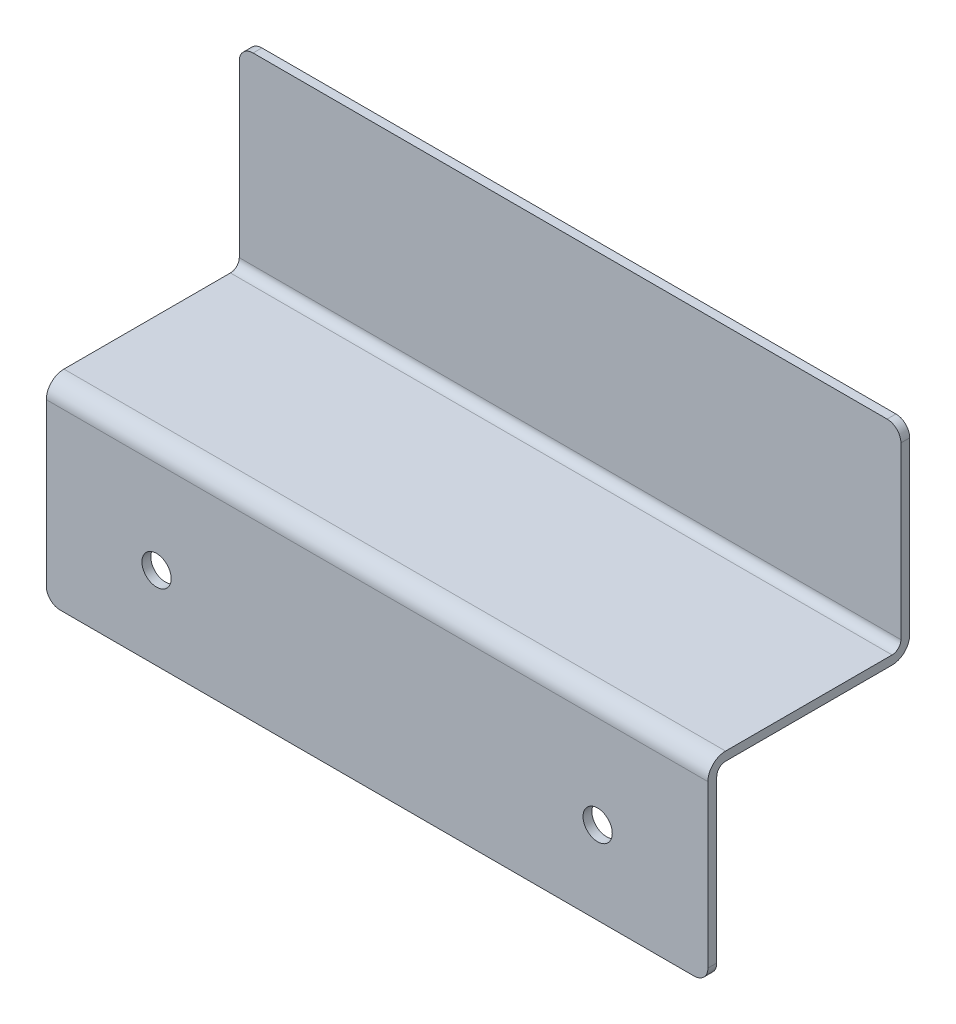
ISO-10303-21;
HEADER;
FILE_DESCRIPTION(('STEP AP214'),'2;1');
FILE_NAME('part.step','',(''),(''),'','','');
FILE_SCHEMA(('AUTOMOTIVE_DESIGN { 1 0 10303 214 1 1 1 1 }'));
ENDSEC;
DATA;
#1=APPLICATION_CONTEXT('core data for automotive mechanical design processes');
#2=APPLICATION_PROTOCOL_DEFINITION('international standard','automotive_design',2000,#1);
#3=PRODUCT_CONTEXT('',#1,'mechanical');
#4=PRODUCT('Part','Part','',(#3));
#5=PRODUCT_RELATED_PRODUCT_CATEGORY('part','',(#4));
#6=PRODUCT_DEFINITION_FORMATION('','',#4);
#7=PRODUCT_DEFINITION_CONTEXT('part definition',#1,'design');
#8=PRODUCT_DEFINITION('design','',#6,#7);
#9=PRODUCT_DEFINITION_SHAPE('','',#8);
#10=(LENGTH_UNIT() NAMED_UNIT(*) SI_UNIT(.MILLI.,.METRE.));
#11=(NAMED_UNIT(*) PLANE_ANGLE_UNIT() SI_UNIT($,.RADIAN.));
#12=(NAMED_UNIT(*) SI_UNIT($,.STERADIAN.) SOLID_ANGLE_UNIT());
#13=UNCERTAINTY_MEASURE_WITH_UNIT(LENGTH_MEASURE(1.E-05),#10,'distance_accuracy_value','');
#14=(GEOMETRIC_REPRESENTATION_CONTEXT(3) GLOBAL_UNCERTAINTY_ASSIGNED_CONTEXT((#13)) GLOBAL_UNIT_ASSIGNED_CONTEXT((#10,
#11,#12)) REPRESENTATION_CONTEXT('',''));
#15=CARTESIAN_POINT('',(0.,0.,0.));
#16=DIRECTION('',(0.,0.,1.));
#17=DIRECTION('',(1.,0.,0.));
#18=AXIS2_PLACEMENT_3D('',#15,#16,#17);
#19=CARTESIAN_POINT('',(152.4,0.,0.));
#20=DIRECTION('',(0.,-1.,0.));
#21=DIRECTION('',(0.,0.,-1.));
#22=AXIS2_PLACEMENT_3D('',#19,#20,#21);
#23=PLANE('',#22);
#24=DIRECTION('',(-1.,0.,0.));
#25=VECTOR('',#24,1.);
#26=CARTESIAN_POINT('',(152.4,0.,-2.032));
#27=LINE('',#26,#25);
#28=CARTESIAN_POINT('',(149.225,0.,-2.032));
#29=VERTEX_POINT('',#28);
#30=CARTESIAN_POINT('',(3.17500000000007,0.,-2.032));
#31=VERTEX_POINT('',#30);
#32=EDGE_CURVE('E192',#29,#31,#27,.T.);
#33=ORIENTED_EDGE('',*,*,#32,.T.);
#34=DIRECTION('',(0.,0.,1.));
#35=VECTOR('',#34,1.);
#36=CARTESIAN_POINT('',(3.17500000000001,0.,0.));
#37=LINE('',#36,#35);
#38=CARTESIAN_POINT('',(3.17500000000007,0.,0.));
#39=VERTEX_POINT('',#38);
#40=EDGE_CURVE('E252',#31,#39,#37,.T.);
#41=ORIENTED_EDGE('',*,*,#40,.T.);
#42=DIRECTION('',(-1.,0.,0.));
#43=VECTOR('',#42,1.);
#44=CARTESIAN_POINT('',(152.4,0.,0.));
#45=LINE('',#44,#43);
#46=CARTESIAN_POINT('',(149.225,0.,0.));
#47=VERTEX_POINT('',#46);
#48=EDGE_CURVE('E177',#47,#39,#45,.T.);
#49=ORIENTED_EDGE('',*,*,#48,.F.);
#50=DIRECTION('',(0.,0.,1.));
#51=VECTOR('',#50,1.);
#52=CARTESIAN_POINT('',(149.225,0.,0.));
#53=LINE('',#52,#51);
#54=EDGE_CURVE('E250',#47,#29,#53,.F.);
#55=ORIENTED_EDGE('',*,*,#54,.T.);
#56=EDGE_LOOP('',(#33,#41,#49,#55));
#57=FACE_BOUND('',#56,.T.);
#58=ADVANCED_FACE('F37',(#57),#23,.F.);
#59=CARTESIAN_POINT('',(152.4,0.,0.));
#60=DIRECTION('',(0.,0.,-1.));
#61=DIRECTION('',(0.,1.,0.));
#62=AXIS2_PLACEMENT_3D('',#59,#60,#61);
#63=PLANE('',#62);
#64=ORIENTED_EDGE('',*,*,#48,.T.);
#65=CARTESIAN_POINT('',(3.17500000000001,-3.175,0.));
#66=DIRECTION('',(0.,0.,-1.));
#67=DIRECTION('',(0.,1.,0.));
#68=AXIS2_PLACEMENT_3D('',#65,#66,#67);
#69=CIRCLE('',#68,3.175);
#70=CARTESIAN_POINT('',(0.,-3.175,0.));
#71=VERTEX_POINT('',#70);
#72=EDGE_CURVE('E256',#39,#71,#69,.F.);
#73=ORIENTED_EDGE('',*,*,#72,.T.);
#74=DIRECTION('',(0.,-1.,0.));
#75=VECTOR('',#74,1.);
#76=CARTESIAN_POINT('',(0.,0.,0.));
#77=LINE('',#76,#75);
#78=CARTESIAN_POINT('',(0.,-42.418,0.));
#79=VERTEX_POINT('',#78);
#80=EDGE_CURVE('E267',#71,#79,#77,.T.);
#81=ORIENTED_EDGE('',*,*,#80,.T.);
#82=DIRECTION('',(-1.,0.,0.));
#83=VECTOR('',#82,1.);
#84=CARTESIAN_POINT('',(152.4,-42.418,0.));
#85=LINE('',#84,#83);
#86=CARTESIAN_POINT('',(152.4,-42.418,0.));
#87=VERTEX_POINT('',#86);
#88=EDGE_CURVE('E167',#79,#87,#85,.F.);
#89=ORIENTED_EDGE('',*,*,#88,.T.);
#90=DIRECTION('',(0.,-1.,0.));
#91=VECTOR('',#90,1.);
#92=CARTESIAN_POINT('',(152.4,0.,0.));
#93=LINE('',#92,#91);
#94=CARTESIAN_POINT('',(152.4,-3.175,0.));
#95=VERTEX_POINT('',#94);
#96=EDGE_CURVE('E186',#95,#87,#93,.T.);
#97=ORIENTED_EDGE('',*,*,#96,.F.);
#98=CARTESIAN_POINT('',(149.225,-3.175,0.));
#99=DIRECTION('',(0.,0.,-1.));
#100=DIRECTION('',(0.,1.,0.));
#101=AXIS2_PLACEMENT_3D('',#98,#99,#100);
#102=CIRCLE('',#101,3.175);
#103=EDGE_CURVE('E62',#95,#47,#102,.F.);
#104=ORIENTED_EDGE('',*,*,#103,.T.);
#105=EDGE_LOOP('',(#64,#73,#81,#89,#97,#104));
#106=FACE_BOUND('',#105,.T.);
#107=ADVANCED_FACE('F339',(#106),#63,.F.);
#108=CARTESIAN_POINT('',(152.4,-44.45,0.));
#109=DIRECTION('',(0.,-1.,0.));
#110=DIRECTION('',(0.,0.,-1.));
#111=AXIS2_PLACEMENT_3D('',#108,#109,#110);
#112=PLANE('',#111);
#113=DIRECTION('',(0.,0.,1.));
#114=VECTOR('',#113,1.);
#115=CARTESIAN_POINT('',(0.,-44.45,0.));
#116=LINE('',#115,#114);
#117=CARTESIAN_POINT('',(0.,-44.45,2.03199999999999));
#118=VERTEX_POINT('',#117);
#119=CARTESIAN_POINT('',(0.,-44.45,40.386));
#120=VERTEX_POINT('',#119);
#121=EDGE_CURVE('E288',#118,#120,#116,.T.);
#122=ORIENTED_EDGE('',*,*,#121,.T.);
#123=DIRECTION('',(-1.,0.,0.));
#124=VECTOR('',#123,1.);
#125=CARTESIAN_POINT('',(152.4,-44.45,40.386));
#126=LINE('',#125,#124);
#127=CARTESIAN_POINT('',(152.4,-44.45,40.386));
#128=VERTEX_POINT('',#127);
#129=EDGE_CURVE('E222',#120,#128,#126,.F.);
#130=ORIENTED_EDGE('',*,*,#129,.T.);
#131=DIRECTION('',(0.,0.,1.));
#132=VECTOR('',#131,1.);
#133=CARTESIAN_POINT('',(152.4,-44.45,0.));
#134=LINE('',#133,#132);
#135=CARTESIAN_POINT('',(152.4,-44.45,2.03199999999999));
#136=VERTEX_POINT('',#135);
#137=EDGE_CURVE('E277',#136,#128,#134,.T.);
#138=ORIENTED_EDGE('',*,*,#137,.F.);
#139=DIRECTION('',(-1.,0.,0.));
#140=VECTOR('',#139,1.);
#141=CARTESIAN_POINT('',(0.,-44.45,2.03199999999999));
#142=LINE('',#141,#140);
#143=EDGE_CURVE('E205',#136,#118,#142,.T.);
#144=ORIENTED_EDGE('',*,*,#143,.T.);
#145=EDGE_LOOP('',(#122,#130,#138,#144));
#146=FACE_BOUND('',#145,.T.);
#147=ADVANCED_FACE('F321',(#146),#112,.F.);
#148=CARTESIAN_POINT('',(152.4,-44.45,44.45));
#149=DIRECTION('',(0.,0.,-1.));
#150=DIRECTION('',(0.,1.,0.));
#151=AXIS2_PLACEMENT_3D('',#148,#149,#150);
#152=PLANE('',#151);
#153=CARTESIAN_POINT('',(25.4,-69.85,44.45));
#154=DIRECTION('',(0.,0.,1.));
#155=DIRECTION('',(1.,0.,0.));
#156=AXIS2_PLACEMENT_3D('',#153,#154,#155);
#157=CIRCLE('',#156,3.3655);
#158=CARTESIAN_POINT('',(28.7655,-69.85,44.45));
#159=VERTEX_POINT('',#158);
#160=EDGE_CURVE('E263',#159,#159,#157,.T.);
#161=ORIENTED_EDGE('',*,*,#160,.F.);
#162=EDGE_LOOP('',(#161));
#163=FACE_BOUND('',#162,.T.);
#164=CARTESIAN_POINT('',(127.,-69.85,44.45));
#165=DIRECTION('',(0.,0.,1.));
#166=DIRECTION('',(1.,0.,0.));
#167=AXIS2_PLACEMENT_3D('',#164,#165,#166);
#168=CIRCLE('',#167,3.36549999999999);
#169=CARTESIAN_POINT('',(130.3655,-69.85,44.45));
#170=VERTEX_POINT('',#169);
#171=EDGE_CURVE('E269',#170,#170,#168,.T.);
#172=ORIENTED_EDGE('',*,*,#171,.F.);
#173=EDGE_LOOP('',(#172));
#174=FACE_BOUND('',#173,.T.);
#175=DIRECTION('',(0.,-1.,0.));
#176=VECTOR('',#175,1.);
#177=CARTESIAN_POINT('',(0.,-44.45,44.45));
#178=LINE('',#177,#176);
#179=CARTESIAN_POINT('',(0.,-48.514,44.45));
#180=VERTEX_POINT('',#179);
#181=CARTESIAN_POINT('',(0.,-85.725,44.45));
#182=VERTEX_POINT('',#181);
#183=EDGE_CURVE('E188',#180,#182,#178,.T.);
#184=ORIENTED_EDGE('',*,*,#183,.T.);
#185=CARTESIAN_POINT('',(3.17500000000001,-85.725,44.45));
#186=DIRECTION('',(0.,0.,-1.));
#187=DIRECTION('',(0.,1.,0.));
#188=AXIS2_PLACEMENT_3D('',#185,#186,#187);
#189=CIRCLE('',#188,3.175);
#190=CARTESIAN_POINT('',(3.17500000000007,-88.9,44.45));
#191=VERTEX_POINT('',#190);
#192=EDGE_CURVE('E248',#182,#191,#189,.F.);
#193=ORIENTED_EDGE('',*,*,#192,.T.);
#194=DIRECTION('',(-1.,0.,0.));
#195=VECTOR('',#194,1.);
#196=CARTESIAN_POINT('',(152.4,-88.9,44.45));
#197=LINE('',#196,#195);
#198=CARTESIAN_POINT('',(149.225,-88.9,44.45));
#199=VERTEX_POINT('',#198);
#200=EDGE_CURVE('E199',#199,#191,#197,.T.);
#201=ORIENTED_EDGE('',*,*,#200,.F.);
#202=CARTESIAN_POINT('',(149.225,-85.725,44.45));
#203=DIRECTION('',(0.,0.,-1.));
#204=DIRECTION('',(0.,1.,0.));
#205=AXIS2_PLACEMENT_3D('',#202,#203,#204);
#206=CIRCLE('',#205,3.175);
#207=CARTESIAN_POINT('',(152.4,-85.725,44.45));
#208=VERTEX_POINT('',#207);
#209=EDGE_CURVE('E246',#199,#208,#206,.F.);
#210=ORIENTED_EDGE('',*,*,#209,.T.);
#211=DIRECTION('',(0.,-1.,0.));
#212=VECTOR('',#211,1.);
#213=CARTESIAN_POINT('',(152.4,-44.45,44.45));
#214=LINE('',#213,#212);
#215=CARTESIAN_POINT('',(152.4,-48.514,44.45));
#216=VERTEX_POINT('',#215);
#217=EDGE_CURVE('E280',#216,#208,#214,.T.);
#218=ORIENTED_EDGE('',*,*,#217,.F.);
#219=DIRECTION('',(-1.,0.,0.));
#220=VECTOR('',#219,1.);
#221=CARTESIAN_POINT('',(152.4,-48.514,44.45));
#222=LINE('',#221,#220);
#223=EDGE_CURVE('E216',#216,#180,#222,.T.);
#224=ORIENTED_EDGE('',*,*,#223,.T.);
#225=EDGE_LOOP('',(#184,#193,#201,#210,#218,#224));
#226=FACE_BOUND('',#225,.T.);
#227=ADVANCED_FACE('F294',(#163,#174,#226),#152,.F.);
#228=CARTESIAN_POINT('',(152.4,-88.9,44.45));
#229=DIRECTION('',(0.,1.,0.));
#230=DIRECTION('',(0.,0.,1.));
#231=AXIS2_PLACEMENT_3D('',#228,#229,#230);
#232=PLANE('',#231);
#233=ORIENTED_EDGE('',*,*,#200,.T.);
#234=DIRECTION('',(0.,0.,-1.));
#235=VECTOR('',#234,1.);
#236=CARTESIAN_POINT('',(3.17500000000001,-88.9,42.418));
#237=LINE('',#236,#235);
#238=CARTESIAN_POINT('',(3.17500000000007,-88.9,42.418));
#239=VERTEX_POINT('',#238);
#240=EDGE_CURVE('E235',#191,#239,#237,.T.);
#241=ORIENTED_EDGE('',*,*,#240,.T.);
#242=DIRECTION('',(-1.,0.,0.));
#243=VECTOR('',#242,1.);
#244=CARTESIAN_POINT('',(152.4,-88.9,42.418));
#245=LINE('',#244,#243);
#246=CARTESIAN_POINT('',(149.225,-88.9,42.418));
#247=VERTEX_POINT('',#246);
#248=EDGE_CURVE('E195',#247,#239,#245,.T.);
#249=ORIENTED_EDGE('',*,*,#248,.F.);
#250=DIRECTION('',(0.,0.,-1.));
#251=VECTOR('',#250,1.);
#252=CARTESIAN_POINT('',(149.225,-88.9,44.45));
#253=LINE('',#252,#251);
#254=EDGE_CURVE('E233',#247,#199,#253,.F.);
#255=ORIENTED_EDGE('',*,*,#254,.T.);
#256=EDGE_LOOP('',(#233,#241,#249,#255));
#257=FACE_BOUND('',#256,.T.);
#258=ADVANCED_FACE('F304',(#257),#232,.F.);
#259=CARTESIAN_POINT('',(152.4,-46.482,42.418));
#260=DIRECTION('',(0.,0.,1.));
#261=DIRECTION('',(0.,-1.,0.));
#262=AXIS2_PLACEMENT_3D('',#259,#260,#261);
#263=PLANE('',#262);
#264=CARTESIAN_POINT('',(25.4,-69.85,42.418));
#265=DIRECTION('',(0.,0.,1.));
#266=DIRECTION('',(0.,-1.,0.));
#267=AXIS2_PLACEMENT_3D('',#264,#265,#266);
#268=CIRCLE('',#267,3.3655);
#269=CARTESIAN_POINT('',(25.4,-73.2155,42.418));
#270=VERTEX_POINT('',#269);
#271=EDGE_CURVE('E41',#270,#270,#268,.T.);
#272=ORIENTED_EDGE('',*,*,#271,.T.);
#273=EDGE_LOOP('',(#272));
#274=FACE_BOUND('',#273,.T.);
#275=CARTESIAN_POINT('',(127.,-69.85,42.418));
#276=DIRECTION('',(0.,0.,1.));
#277=DIRECTION('',(0.,-1.,0.));
#278=AXIS2_PLACEMENT_3D('',#275,#276,#277);
#279=CIRCLE('',#278,3.36549999999999);
#280=CARTESIAN_POINT('',(127.,-73.2155,42.418));
#281=VERTEX_POINT('',#280);
#282=EDGE_CURVE('E261',#281,#281,#279,.T.);
#283=ORIENTED_EDGE('',*,*,#282,.T.);
#284=EDGE_LOOP('',(#283));
#285=FACE_BOUND('',#284,.T.);
#286=ORIENTED_EDGE('',*,*,#248,.T.);
#287=CARTESIAN_POINT('',(3.17500000000001,-85.725,42.418));
#288=DIRECTION('',(0.,0.,1.));
#289=DIRECTION('',(0.,-1.,0.));
#290=AXIS2_PLACEMENT_3D('',#287,#288,#289);
#291=CIRCLE('',#290,3.175);
#292=CARTESIAN_POINT('',(0.,-85.725,42.418));
#293=VERTEX_POINT('',#292);
#294=EDGE_CURVE('E240',#239,#293,#291,.F.);
#295=ORIENTED_EDGE('',*,*,#294,.T.);
#296=DIRECTION('',(0.,1.,0.));
#297=VECTOR('',#296,1.);
#298=CARTESIAN_POINT('',(0.,-46.482,42.418));
#299=LINE('',#298,#297);
#300=CARTESIAN_POINT('',(0.,-48.514,42.418));
#301=VERTEX_POINT('',#300);
#302=EDGE_CURVE('E183',#293,#301,#299,.T.);
#303=ORIENTED_EDGE('',*,*,#302,.T.);
#304=DIRECTION('',(-1.,0.,0.));
#305=VECTOR('',#304,1.);
#306=CARTESIAN_POINT('',(152.4,-48.514,42.418));
#307=LINE('',#306,#305);
#308=CARTESIAN_POINT('',(152.4,-48.514,42.418));
#309=VERTEX_POINT('',#308);
#310=EDGE_CURVE('E162',#301,#309,#307,.F.);
#311=ORIENTED_EDGE('',*,*,#310,.T.);
#312=DIRECTION('',(0.,1.,0.));
#313=VECTOR('',#312,1.);
#314=CARTESIAN_POINT('',(152.4,-46.482,42.418));
#315=LINE('',#314,#313);
#316=CARTESIAN_POINT('',(152.4,-85.725,42.418));
#317=VERTEX_POINT('',#316);
#318=EDGE_CURVE('E283',#317,#309,#315,.T.);
#319=ORIENTED_EDGE('',*,*,#318,.F.);
#320=CARTESIAN_POINT('',(149.225,-85.725,42.418));
#321=DIRECTION('',(0.,0.,1.));
#322=DIRECTION('',(0.,-1.,0.));
#323=AXIS2_PLACEMENT_3D('',#320,#321,#322);
#324=CIRCLE('',#323,3.175);
#325=EDGE_CURVE('E238',#317,#247,#324,.F.);
#326=ORIENTED_EDGE('',*,*,#325,.T.);
#327=EDGE_LOOP('',(#286,#295,#303,#311,#319,#326));
#328=FACE_BOUND('',#327,.T.);
#329=ADVANCED_FACE('F307',(#274,#285,#328),#263,.F.);
#330=CARTESIAN_POINT('',(152.4,-46.482,-2.03200000000001));
#331=DIRECTION('',(0.,1.,0.));
#332=DIRECTION('',(0.,0.,1.));
#333=AXIS2_PLACEMENT_3D('',#330,#331,#332);
#334=PLANE('',#333);
#335=DIRECTION('',(0.,0.,-1.));
#336=VECTOR('',#335,1.);
#337=CARTESIAN_POINT('',(0.,-46.482,-2.03200000000001));
#338=LINE('',#337,#336);
#339=CARTESIAN_POINT('',(0.,-46.482,40.386));
#340=VERTEX_POINT('',#339);
#341=CARTESIAN_POINT('',(0.,-46.482,2.03199999999999));
#342=VERTEX_POINT('',#341);
#343=EDGE_CURVE('E173',#340,#342,#338,.T.);
#344=ORIENTED_EDGE('',*,*,#343,.T.);
#345=DIRECTION('',(-1.,0.,0.));
#346=VECTOR('',#345,1.);
#347=CARTESIAN_POINT('',(152.4,-46.482,2.03199999999999));
#348=LINE('',#347,#346);
#349=CARTESIAN_POINT('',(152.4,-46.482,2.03199999999999));
#350=VERTEX_POINT('',#349);
#351=EDGE_CURVE('E231',#342,#350,#348,.F.);
#352=ORIENTED_EDGE('',*,*,#351,.T.);
#353=DIRECTION('',(0.,0.,-1.));
#354=VECTOR('',#353,1.);
#355=CARTESIAN_POINT('',(152.4,-46.482,-2.03200000000001));
#356=LINE('',#355,#354);
#357=CARTESIAN_POINT('',(152.4,-46.482,40.386));
#358=VERTEX_POINT('',#357);
#359=EDGE_CURVE('E176',#358,#350,#356,.T.);
#360=ORIENTED_EDGE('',*,*,#359,.F.);
#361=DIRECTION('',(-1.,0.,0.));
#362=VECTOR('',#361,1.);
#363=CARTESIAN_POINT('',(0.,-46.482,40.386));
#364=LINE('',#363,#362);
#365=EDGE_CURVE('E160',#358,#340,#364,.T.);
#366=ORIENTED_EDGE('',*,*,#365,.T.);
#367=EDGE_LOOP('',(#344,#352,#360,#366));
#368=FACE_BOUND('',#367,.T.);
#369=ADVANCED_FACE('F172',(#368),#334,.F.);
#370=CARTESIAN_POINT('',(152.4,0.,-2.032));
#371=DIRECTION('',(0.,0.,1.));
#372=DIRECTION('',(0.,-1.,0.));
#373=AXIS2_PLACEMENT_3D('',#370,#371,#372);
#374=PLANE('',#373);
#375=DIRECTION('',(0.,1.,0.));
#376=VECTOR('',#375,1.);
#377=CARTESIAN_POINT('',(0.,0.,-2.032));
#378=LINE('',#377,#376);
#379=CARTESIAN_POINT('',(0.,-42.418,-2.03200000000001));
#380=VERTEX_POINT('',#379);
#381=CARTESIAN_POINT('',(0.,-3.175,-2.032));
#382=VERTEX_POINT('',#381);
#383=EDGE_CURVE('E182',#380,#382,#378,.T.);
#384=ORIENTED_EDGE('',*,*,#383,.T.);
#385=CARTESIAN_POINT('',(3.17500000000001,-3.175,-2.032));
#386=DIRECTION('',(0.,0.,1.));
#387=DIRECTION('',(0.,-1.,0.));
#388=AXIS2_PLACEMENT_3D('',#385,#386,#387);
#389=CIRCLE('',#388,3.175);
#390=EDGE_CURVE('E259',#382,#31,#389,.F.);
#391=ORIENTED_EDGE('',*,*,#390,.T.);
#392=ORIENTED_EDGE('',*,*,#32,.F.);
#393=CARTESIAN_POINT('',(149.225,-3.175,-2.032));
#394=DIRECTION('',(0.,0.,1.));
#395=DIRECTION('',(0.,-1.,0.));
#396=AXIS2_PLACEMENT_3D('',#393,#394,#395);
#397=CIRCLE('',#396,3.175);
#398=CARTESIAN_POINT('',(152.4,-3.175,-2.032));
#399=VERTEX_POINT('',#398);
#400=EDGE_CURVE('E54',#29,#399,#397,.F.);
#401=ORIENTED_EDGE('',*,*,#400,.T.);
#402=DIRECTION('',(0.,1.,0.));
#403=VECTOR('',#402,1.);
#404=CARTESIAN_POINT('',(152.4,0.,-2.032));
#405=LINE('',#404,#403);
#406=CARTESIAN_POINT('',(152.4,-42.418,-2.03200000000001));
#407=VERTEX_POINT('',#406);
#408=EDGE_CURVE('E196',#407,#399,#405,.T.);
#409=ORIENTED_EDGE('',*,*,#408,.F.);
#410=DIRECTION('',(-1.,0.,0.));
#411=VECTOR('',#410,1.);
#412=CARTESIAN_POINT('',(152.4,-42.418,-2.03200000000001));
#413=LINE('',#412,#411);
#414=EDGE_CURVE('E228',#407,#380,#413,.T.);
#415=ORIENTED_EDGE('',*,*,#414,.T.);
#416=EDGE_LOOP('',(#384,#391,#392,#401,#409,#415));
#417=FACE_BOUND('',#416,.T.);
#418=ADVANCED_FACE('F335',(#417),#374,.F.);
#419=CARTESIAN_POINT('',(152.4,0.,0.));
#420=DIRECTION('',(-1.,0.,0.));
#421=DIRECTION('',(0.,0.,1.));
#422=AXIS2_PLACEMENT_3D('',#419,#420,#421);
#423=PLANE('',#422);
#424=ORIENTED_EDGE('',*,*,#217,.T.);
#425=DIRECTION('',(0.,0.,-1.));
#426=VECTOR('',#425,1.);
#427=CARTESIAN_POINT('',(152.4,-85.725,0.));
#428=LINE('',#427,#426);
#429=EDGE_CURVE('E11',#208,#317,#428,.T.);
#430=ORIENTED_EDGE('',*,*,#429,.T.);
#431=ORIENTED_EDGE('',*,*,#318,.T.);
#432=CARTESIAN_POINT('',(152.4,-48.514,40.386));
#433=DIRECTION('',(-1.,0.,0.));
#434=DIRECTION('',(0.,0.,1.));
#435=AXIS2_PLACEMENT_3D('',#432,#433,#434);
#436=CIRCLE('',#435,2.032);
#437=EDGE_CURVE('E166',#309,#358,#436,.T.);
#438=ORIENTED_EDGE('',*,*,#437,.T.);
#439=ORIENTED_EDGE('',*,*,#359,.T.);
#440=CARTESIAN_POINT('',(152.4,-42.418,2.03199999999999));
#441=DIRECTION('',(-1.,0.,0.));
#442=DIRECTION('',(0.,0.,1.));
#443=AXIS2_PLACEMENT_3D('',#440,#441,#442);
#444=CIRCLE('',#443,4.064);
#445=EDGE_CURVE('E224',#350,#407,#444,.F.);
#446=ORIENTED_EDGE('',*,*,#445,.T.);
#447=ORIENTED_EDGE('',*,*,#408,.T.);
#448=DIRECTION('',(0.,0.,1.));
#449=VECTOR('',#448,1.);
#450=CARTESIAN_POINT('',(152.4,-3.175,0.));
#451=LINE('',#450,#449);
#452=EDGE_CURVE('E46',#399,#95,#451,.T.);
#453=ORIENTED_EDGE('',*,*,#452,.T.);
#454=ORIENTED_EDGE('',*,*,#96,.T.);
#455=CARTESIAN_POINT('',(152.4,-42.418,2.03199999999999));
#456=DIRECTION('',(-1.,0.,0.));
#457=DIRECTION('',(0.,0.,1.));
#458=AXIS2_PLACEMENT_3D('',#455,#456,#457);
#459=CIRCLE('',#458,2.032);
#460=EDGE_CURVE('E214',#87,#136,#459,.T.);
#461=ORIENTED_EDGE('',*,*,#460,.T.);
#462=ORIENTED_EDGE('',*,*,#137,.T.);
#463=CARTESIAN_POINT('',(152.4,-48.514,40.386));
#464=DIRECTION('',(-1.,0.,0.));
#465=DIRECTION('',(0.,0.,1.));
#466=AXIS2_PLACEMENT_3D('',#463,#464,#465);
#467=CIRCLE('',#466,4.064);
#468=EDGE_CURVE('E226',#128,#216,#467,.F.);
#469=ORIENTED_EDGE('',*,*,#468,.T.);
#470=EDGE_LOOP('',(#424,#430,#431,#438,#439,#446,#447,#453,#454,#461,#462,#469));
#471=FACE_BOUND('',#470,.T.);
#472=ADVANCED_FACE('F314',(#471),#423,.F.);
#473=CARTESIAN_POINT('',(0.,0.,0.));
#474=DIRECTION('',(-1.,0.,0.));
#475=DIRECTION('',(0.,0.,1.));
#476=AXIS2_PLACEMENT_3D('',#473,#474,#475);
#477=PLANE('',#476);
#478=ORIENTED_EDGE('',*,*,#302,.F.);
#479=DIRECTION('',(0.,0.,-1.));
#480=VECTOR('',#479,1.);
#481=CARTESIAN_POINT('',(0.,-85.725,44.45));
#482=LINE('',#481,#480);
#483=EDGE_CURVE('E244',#293,#182,#482,.F.);
#484=ORIENTED_EDGE('',*,*,#483,.T.);
#485=ORIENTED_EDGE('',*,*,#183,.F.);
#486=CARTESIAN_POINT('',(0.,-48.514,40.386));
#487=DIRECTION('',(-1.,0.,0.));
#488=DIRECTION('',(0.,0.,1.));
#489=AXIS2_PLACEMENT_3D('',#486,#487,#488);
#490=CIRCLE('',#489,4.064);
#491=EDGE_CURVE('E220',#180,#120,#490,.T.);
#492=ORIENTED_EDGE('',*,*,#491,.T.);
#493=ORIENTED_EDGE('',*,*,#121,.F.);
#494=CARTESIAN_POINT('',(0.,-42.418,2.03199999999999));
#495=DIRECTION('',(-1.,0.,0.));
#496=DIRECTION('',(0.,0.,1.));
#497=AXIS2_PLACEMENT_3D('',#494,#495,#496);
#498=CIRCLE('',#497,2.032);
#499=EDGE_CURVE('E211',#118,#79,#498,.F.);
#500=ORIENTED_EDGE('',*,*,#499,.T.);
#501=ORIENTED_EDGE('',*,*,#80,.F.);
#502=DIRECTION('',(0.,0.,1.));
#503=VECTOR('',#502,1.);
#504=CARTESIAN_POINT('',(0.,-3.175,-2.032));
#505=LINE('',#504,#503);
#506=EDGE_CURVE('E242',#71,#382,#505,.F.);
#507=ORIENTED_EDGE('',*,*,#506,.T.);
#508=ORIENTED_EDGE('',*,*,#383,.F.);
#509=CARTESIAN_POINT('',(0.,-42.418,2.03199999999999));
#510=DIRECTION('',(-1.,0.,0.));
#511=DIRECTION('',(0.,0.,1.));
#512=AXIS2_PLACEMENT_3D('',#509,#510,#511);
#513=CIRCLE('',#512,4.064);
#514=EDGE_CURVE('E181',#380,#342,#513,.T.);
#515=ORIENTED_EDGE('',*,*,#514,.T.);
#516=ORIENTED_EDGE('',*,*,#343,.F.);
#517=CARTESIAN_POINT('',(0.,-48.514,40.386));
#518=DIRECTION('',(-1.,0.,0.));
#519=DIRECTION('',(0.,0.,1.));
#520=AXIS2_PLACEMENT_3D('',#517,#518,#519);
#521=CIRCLE('',#520,2.032);
#522=EDGE_CURVE('E156',#340,#301,#521,.F.);
#523=ORIENTED_EDGE('',*,*,#522,.T.);
#524=EDGE_LOOP('',(#478,#484,#485,#492,#493,#500,#501,#507,#508,#515,#516,#523));
#525=FACE_BOUND('',#524,.T.);
#526=ADVANCED_FACE('F179',(#525),#477,.T.);
#527=CARTESIAN_POINT('',(152.4,-48.514,40.386));
#528=DIRECTION('',(1.,0.,0.));
#529=DIRECTION('',(0.,0.,-1.));
#530=AXIS2_PLACEMENT_3D('',#527,#528,#529);
#531=CYLINDRICAL_SURFACE('',#530,2.032);
#532=ORIENTED_EDGE('',*,*,#437,.F.);
#533=ORIENTED_EDGE('',*,*,#310,.F.);
#534=ORIENTED_EDGE('',*,*,#522,.F.);
#535=ORIENTED_EDGE('',*,*,#365,.F.);
#536=EDGE_LOOP('',(#532,#533,#534,#535));
#537=FACE_BOUND('',#536,.T.);
#538=ADVANCED_FACE('F159',(#537),#531,.F.);
#539=CARTESIAN_POINT('',(152.4,-42.418,2.03199999999999));
#540=DIRECTION('',(1.,0.,0.));
#541=DIRECTION('',(0.,0.,-1.));
#542=AXIS2_PLACEMENT_3D('',#539,#540,#541);
#543=CYLINDRICAL_SURFACE('',#542,2.032);
#544=ORIENTED_EDGE('',*,*,#460,.F.);
#545=ORIENTED_EDGE('',*,*,#88,.F.);
#546=ORIENTED_EDGE('',*,*,#499,.F.);
#547=ORIENTED_EDGE('',*,*,#143,.F.);
#548=EDGE_LOOP('',(#544,#545,#546,#547));
#549=FACE_BOUND('',#548,.T.);
#550=ADVANCED_FACE('F326',(#549),#543,.F.);
#551=CARTESIAN_POINT('',(152.4,-48.514,40.386));
#552=DIRECTION('',(-1.,0.,0.));
#553=DIRECTION('',(0.,0.,1.));
#554=AXIS2_PLACEMENT_3D('',#551,#552,#553);
#555=CYLINDRICAL_SURFACE('',#554,4.064);
#556=ORIENTED_EDGE('',*,*,#468,.F.);
#557=ORIENTED_EDGE('',*,*,#129,.F.);
#558=ORIENTED_EDGE('',*,*,#491,.F.);
#559=ORIENTED_EDGE('',*,*,#223,.F.);
#560=EDGE_LOOP('',(#556,#557,#558,#559));
#561=FACE_BOUND('',#560,.T.);
#562=ADVANCED_FACE('F317',(#561),#555,.T.);
#563=CARTESIAN_POINT('',(152.4,-42.418,2.03199999999999));
#564=DIRECTION('',(-1.,0.,0.));
#565=DIRECTION('',(0.,0.,1.));
#566=AXIS2_PLACEMENT_3D('',#563,#564,#565);
#567=CYLINDRICAL_SURFACE('',#566,4.064);
#568=ORIENTED_EDGE('',*,*,#445,.F.);
#569=ORIENTED_EDGE('',*,*,#351,.F.);
#570=ORIENTED_EDGE('',*,*,#514,.F.);
#571=ORIENTED_EDGE('',*,*,#414,.F.);
#572=EDGE_LOOP('',(#568,#569,#570,#571));
#573=FACE_BOUND('',#572,.T.);
#574=ADVANCED_FACE('F357',(#573),#567,.T.);
#575=CARTESIAN_POINT('',(3.17500000000001,-85.725,44.45));
#576=DIRECTION('',(0.,0.,1.));
#577=DIRECTION('',(1.,0.,0.));
#578=AXIS2_PLACEMENT_3D('',#575,#576,#577);
#579=CYLINDRICAL_SURFACE('',#578,3.175);
#580=ORIENTED_EDGE('',*,*,#192,.F.);
#581=ORIENTED_EDGE('',*,*,#483,.F.);
#582=ORIENTED_EDGE('',*,*,#294,.F.);
#583=ORIENTED_EDGE('',*,*,#240,.F.);
#584=EDGE_LOOP('',(#580,#581,#582,#583));
#585=FACE_BOUND('',#584,.T.);
#586=ADVANCED_FACE('F301',(#585),#579,.T.);
#587=CARTESIAN_POINT('',(3.17500000000001,-3.175,0.));
#588=DIRECTION('',(0.,0.,-1.));
#589=DIRECTION('',(-1.,0.,0.));
#590=AXIS2_PLACEMENT_3D('',#587,#588,#589);
#591=CYLINDRICAL_SURFACE('',#590,3.175);
#592=ORIENTED_EDGE('',*,*,#390,.F.);
#593=ORIENTED_EDGE('',*,*,#506,.F.);
#594=ORIENTED_EDGE('',*,*,#72,.F.);
#595=ORIENTED_EDGE('',*,*,#40,.F.);
#596=EDGE_LOOP('',(#592,#593,#594,#595));
#597=FACE_BOUND('',#596,.T.);
#598=ADVANCED_FACE('F333',(#597),#591,.T.);
#599=CARTESIAN_POINT('',(149.225,-85.725,0.));
#600=DIRECTION('',(0.,0.,-1.));
#601=DIRECTION('',(-1.,0.,0.));
#602=AXIS2_PLACEMENT_3D('',#599,#600,#601);
#603=CYLINDRICAL_SURFACE('',#602,3.175);
#604=ORIENTED_EDGE('',*,*,#209,.F.);
#605=ORIENTED_EDGE('',*,*,#254,.F.);
#606=ORIENTED_EDGE('',*,*,#325,.F.);
#607=ORIENTED_EDGE('',*,*,#429,.F.);
#608=EDGE_LOOP('',(#604,#605,#606,#607));
#609=FACE_BOUND('',#608,.T.);
#610=ADVANCED_FACE('F312',(#609),#603,.T.);
#611=CARTESIAN_POINT('',(149.225,-3.175,0.));
#612=DIRECTION('',(0.,0.,1.));
#613=DIRECTION('',(1.,0.,0.));
#614=AXIS2_PLACEMENT_3D('',#611,#612,#613);
#615=CYLINDRICAL_SURFACE('',#614,3.175);
#616=ORIENTED_EDGE('',*,*,#400,.F.);
#617=ORIENTED_EDGE('',*,*,#54,.F.);
#618=ORIENTED_EDGE('',*,*,#103,.F.);
#619=ORIENTED_EDGE('',*,*,#452,.F.);
#620=EDGE_LOOP('',(#616,#617,#618,#619));
#621=FACE_BOUND('',#620,.T.);
#622=ADVANCED_FACE('F39',(#621),#615,.T.);
#623=CARTESIAN_POINT('',(127.,-69.85,-2.03200000000001));
#624=DIRECTION('',(0.,0.,1.));
#625=DIRECTION('',(1.,0.,0.));
#626=AXIS2_PLACEMENT_3D('',#623,#624,#625);
#627=CYLINDRICAL_SURFACE('',#626,3.36549999999999);
#628=ORIENTED_EDGE('',*,*,#171,.T.);
#629=EDGE_LOOP('',(#628));
#630=FACE_BOUND('',#629,.T.);
#631=ORIENTED_EDGE('',*,*,#282,.F.);
#632=EDGE_LOOP('',(#631));
#633=FACE_BOUND('',#632,.T.);
#634=ADVANCED_FACE('F368',(#630,#633),#627,.F.);
#635=CARTESIAN_POINT('',(25.4,-69.85,-2.03200000000001));
#636=DIRECTION('',(0.,0.,1.));
#637=DIRECTION('',(1.,0.,0.));
#638=AXIS2_PLACEMENT_3D('',#635,#636,#637);
#639=CYLINDRICAL_SURFACE('',#638,3.3655);
#640=ORIENTED_EDGE('',*,*,#160,.T.);
#641=EDGE_LOOP('',(#640));
#642=FACE_BOUND('',#641,.T.);
#643=ORIENTED_EDGE('',*,*,#271,.F.);
#644=EDGE_LOOP('',(#643));
#645=FACE_BOUND('',#644,.T.);
#646=ADVANCED_FACE('F373',(#642,#645),#639,.F.);
#647=CLOSED_SHELL('',(#58,#107,#147,#227,#258,#329,#369,#418,#472,#526,#538,#550,#562,#574,#586,
#598,#610,#622,#634,#646));
#648=MANIFOLD_SOLID_BREP('B2',#647);
#649=ADVANCED_BREP_SHAPE_REPRESENTATION('',(#18,#648),#14);
#650=SHAPE_DEFINITION_REPRESENTATION(#9,#649);
ENDSEC;
END-ISO-10303-21;
